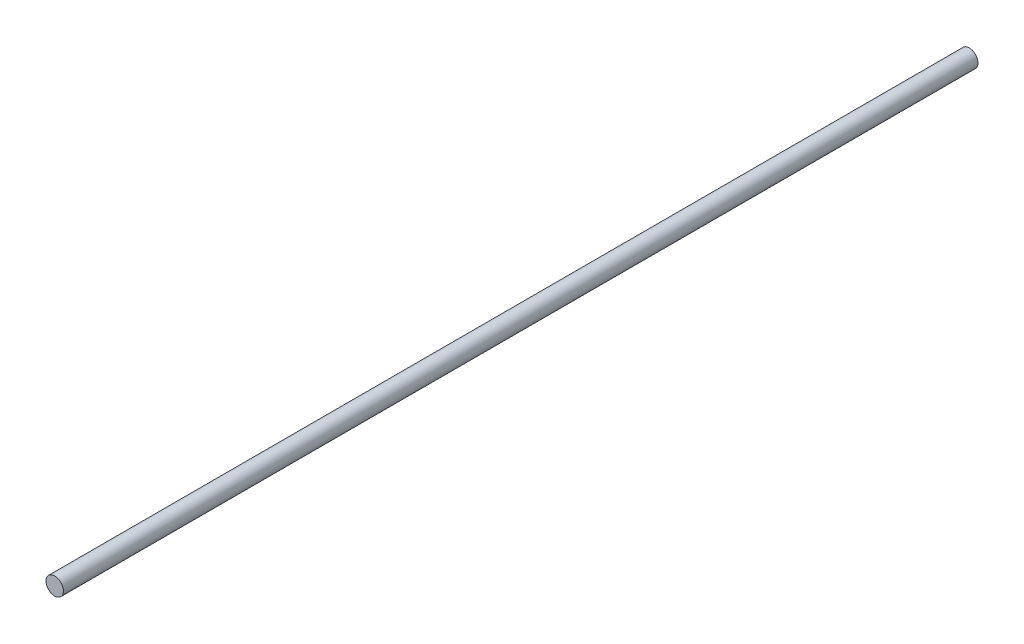
ISO-10303-21;
HEADER;
FILE_DESCRIPTION(('STEP AP214'),'2;1');
FILE_NAME('part.step','',(''),(''),'','','');
FILE_SCHEMA(('AUTOMOTIVE_DESIGN { 1 0 10303 214 1 1 1 1 }'));
ENDSEC;
DATA;
#1=APPLICATION_CONTEXT('core data for automotive mechanical design processes');
#2=APPLICATION_PROTOCOL_DEFINITION('international standard','automotive_design',2000,#1);
#3=PRODUCT_CONTEXT('',#1,'mechanical');
#4=PRODUCT('Part','Part','',(#3));
#5=PRODUCT_RELATED_PRODUCT_CATEGORY('part','',(#4));
#6=PRODUCT_DEFINITION_FORMATION('','',#4);
#7=PRODUCT_DEFINITION_CONTEXT('part definition',#1,'design');
#8=PRODUCT_DEFINITION('design','',#6,#7);
#9=PRODUCT_DEFINITION_SHAPE('','',#8);
#10=(LENGTH_UNIT() NAMED_UNIT(*) SI_UNIT(.MILLI.,.METRE.));
#11=(NAMED_UNIT(*) PLANE_ANGLE_UNIT() SI_UNIT($,.RADIAN.));
#12=(NAMED_UNIT(*) SI_UNIT($,.STERADIAN.) SOLID_ANGLE_UNIT());
#13=UNCERTAINTY_MEASURE_WITH_UNIT(LENGTH_MEASURE(1.E-05),#10,'distance_accuracy_value','');
#14=(GEOMETRIC_REPRESENTATION_CONTEXT(3) GLOBAL_UNCERTAINTY_ASSIGNED_CONTEXT((#13)) GLOBAL_UNIT_ASSIGNED_CONTEXT((#10,
#11,#12)) REPRESENTATION_CONTEXT('',''));
#15=CARTESIAN_POINT('',(0.,0.,0.));
#16=DIRECTION('',(0.,0.,1.));
#17=DIRECTION('',(1.,0.,0.));
#18=AXIS2_PLACEMENT_3D('',#15,#16,#17);
#19=CARTESIAN_POINT('',(0.,0.,420.));
#20=DIRECTION('',(0.,0.,-1.));
#21=DIRECTION('',(-1.,0.,0.));
#22=AXIS2_PLACEMENT_3D('',#19,#20,#21);
#23=CYLINDRICAL_SURFACE('',#22,4.);
#24=CARTESIAN_POINT('',(0.,0.,420.));
#25=DIRECTION('',(0.,0.,1.));
#26=DIRECTION('',(1.,0.,0.));
#27=AXIS2_PLACEMENT_3D('',#24,#25,#26);
#28=CIRCLE('',#27,4.);
#29=CARTESIAN_POINT('',(4.,0.,420.));
#30=VERTEX_POINT('',#29);
#31=EDGE_CURVE('E10',#30,#30,#28,.T.);
#32=ORIENTED_EDGE('',*,*,#31,.F.);
#33=EDGE_LOOP('',(#32));
#34=FACE_BOUND('',#33,.T.);
#35=CARTESIAN_POINT('',(0.,0.,0.));
#36=DIRECTION('',(0.,0.,1.));
#37=DIRECTION('',(1.,0.,0.));
#38=AXIS2_PLACEMENT_3D('',#35,#36,#37);
#39=CIRCLE('',#38,4.);
#40=CARTESIAN_POINT('',(4.,0.,0.));
#41=VERTEX_POINT('',#40);
#42=EDGE_CURVE('E34',#41,#41,#39,.T.);
#43=ORIENTED_EDGE('',*,*,#42,.T.);
#44=EDGE_LOOP('',(#43));
#45=FACE_BOUND('',#44,.T.);
#46=ADVANCED_FACE('F31',(#34,#45),#23,.T.);
#47=CARTESIAN_POINT('',(0.,0.,420.));
#48=DIRECTION('',(0.,0.,1.));
#49=DIRECTION('',(1.,0.,0.));
#50=AXIS2_PLACEMENT_3D('',#47,#48,#49);
#51=PLANE('',#50);
#52=ORIENTED_EDGE('',*,*,#31,.T.);
#53=EDGE_LOOP('',(#52));
#54=FACE_BOUND('',#53,.T.);
#55=ADVANCED_FACE('F46',(#54),#51,.T.);
#56=CARTESIAN_POINT('',(0.,0.,0.));
#57=DIRECTION('',(0.,0.,1.));
#58=DIRECTION('',(1.,0.,0.));
#59=AXIS2_PLACEMENT_3D('',#56,#57,#58);
#60=PLANE('',#59);
#61=ORIENTED_EDGE('',*,*,#42,.F.);
#62=EDGE_LOOP('',(#61));
#63=FACE_BOUND('',#62,.T.);
#64=ADVANCED_FACE('F44',(#63),#60,.F.);
#65=CLOSED_SHELL('',(#46,#55,#64));
#66=MANIFOLD_SOLID_BREP('B2',#65);
#67=ADVANCED_BREP_SHAPE_REPRESENTATION('',(#18,#66),#14);
#68=SHAPE_DEFINITION_REPRESENTATION(#9,#67);
ENDSEC;
END-ISO-10303-21;
